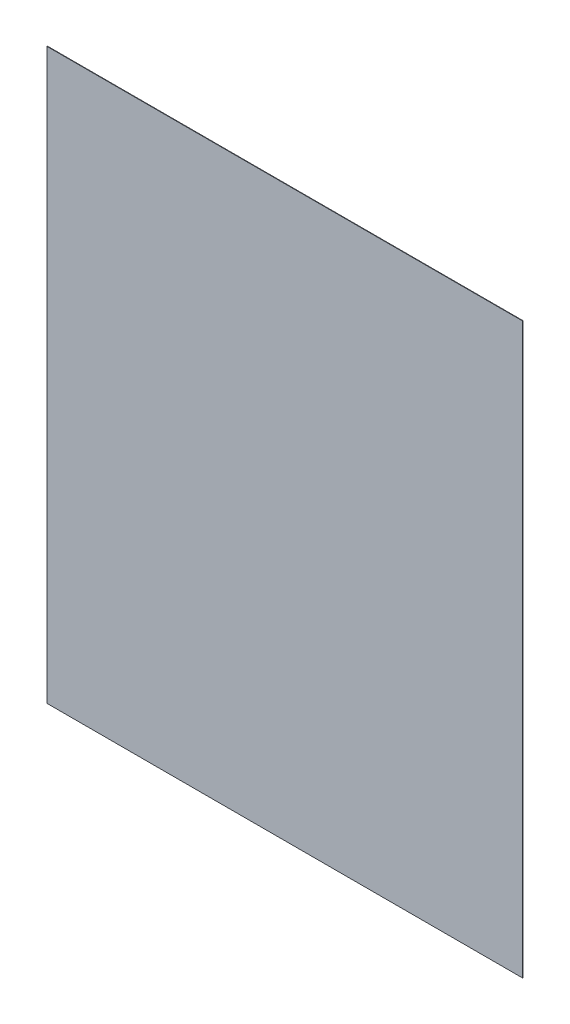
ISO-10303-21;
HEADER;
FILE_DESCRIPTION(('STEP AP214'),'2;1');
FILE_NAME('part.step','',(''),(''),'','','');
FILE_SCHEMA(('AUTOMOTIVE_DESIGN { 1 0 10303 214 1 1 1 1 }'));
ENDSEC;
DATA;
#1=APPLICATION_CONTEXT('core data for automotive mechanical design processes');
#2=APPLICATION_PROTOCOL_DEFINITION('international standard','automotive_design',2000,#1);
#3=PRODUCT_CONTEXT('',#1,'mechanical');
#4=PRODUCT('Part','Part','',(#3));
#5=PRODUCT_RELATED_PRODUCT_CATEGORY('part','',(#4));
#6=PRODUCT_DEFINITION_FORMATION('','',#4);
#7=PRODUCT_DEFINITION_CONTEXT('part definition',#1,'design');
#8=PRODUCT_DEFINITION('design','',#6,#7);
#9=PRODUCT_DEFINITION_SHAPE('','',#8);
#10=(LENGTH_UNIT() NAMED_UNIT(*) SI_UNIT(.MILLI.,.METRE.));
#11=(NAMED_UNIT(*) PLANE_ANGLE_UNIT() SI_UNIT($,.RADIAN.));
#12=(NAMED_UNIT(*) SI_UNIT($,.STERADIAN.) SOLID_ANGLE_UNIT());
#13=UNCERTAINTY_MEASURE_WITH_UNIT(LENGTH_MEASURE(1.E-05),#10,'distance_accuracy_value','');
#14=(GEOMETRIC_REPRESENTATION_CONTEXT(3) GLOBAL_UNCERTAINTY_ASSIGNED_CONTEXT((#13)) GLOBAL_UNIT_ASSIGNED_CONTEXT((#10,
#11,#12)) REPRESENTATION_CONTEXT('',''));
#15=CARTESIAN_POINT('',(0.,0.,0.));
#16=DIRECTION('',(0.,0.,1.));
#17=DIRECTION('',(1.,0.,0.));
#18=AXIS2_PLACEMENT_3D('',#15,#16,#17);
#19=CARTESIAN_POINT('',(-4.825610939252E-05,2.628178783766E-05,0.00100076));
#20=DIRECTION('',(0.,0.,1.));
#21=DIRECTION('',(1.,0.,0.));
#22=AXIS2_PLACEMENT_3D('',#19,#20,#21);
#23=PLANE('',#22);
#24=DIRECTION('',(1.,0.,0.));
#25=VECTOR('',#24,1.);
#26=CARTESIAN_POINT('',(-0.50065178,-0.5986272,0.00100076));
#27=LINE('',#26,#25);
#28=CARTESIAN_POINT('',(-0.50065178,-0.5986272,0.00100076));
#29=VERTEX_POINT('',#28);
#30=CARTESIAN_POINT('',(0.50045874,-0.5986272,0.00100076));
#31=VERTEX_POINT('',#30);
#32=EDGE_CURVE('E90',#29,#31,#27,.T.);
#33=ORIENTED_EDGE('',*,*,#32,.T.);
#34=DIRECTION('',(0.000161235571562526,0.999999987001545,0.));
#35=VECTOR('',#34,1.);
#36=CARTESIAN_POINT('',(0.50045874,-0.5986272,0.00100076));
#37=LINE('',#36,#35);
#38=CARTESIAN_POINT('',(0.50065178,0.5986272,0.00100076));
#39=VERTEX_POINT('',#38);
#40=EDGE_CURVE('E106',#31,#39,#37,.T.);
#41=ORIENTED_EDGE('',*,*,#40,.T.);
#42=DIRECTION('',(-1.,0.,0.));
#43=VECTOR('',#42,1.);
#44=CARTESIAN_POINT('',(0.50065178,0.5986272,0.00100076));
#45=LINE('',#44,#43);
#46=CARTESIAN_POINT('',(-0.50065178,0.5986272,0.00100076));
#47=VERTEX_POINT('',#46);
#48=EDGE_CURVE('E84',#39,#47,#45,.T.);
#49=ORIENTED_EDGE('',*,*,#48,.T.);
#50=DIRECTION('',(0.,-1.,0.));
#51=VECTOR('',#50,1.);
#52=CARTESIAN_POINT('',(-0.50065178,0.5986272,0.00100076));
#53=LINE('',#52,#51);
#54=EDGE_CURVE('E11',#47,#29,#53,.T.);
#55=ORIENTED_EDGE('',*,*,#54,.T.);
#56=EDGE_LOOP('',(#33,#41,#49,#55));
#57=FACE_BOUND('',#56,.T.);
#58=ADVANCED_FACE('F17',(#57),#23,.T.);
#59=CARTESIAN_POINT('',(-4.825610939252E-05,2.628178783766E-05,0.));
#60=DIRECTION('',(0.,0.,1.));
#61=DIRECTION('',(1.,0.,0.));
#62=AXIS2_PLACEMENT_3D('',#59,#60,#61);
#63=PLANE('',#62);
#64=DIRECTION('',(0.,-1.,0.));
#65=VECTOR('',#64,1.);
#66=CARTESIAN_POINT('',(-0.50065178,0.5986272,0.));
#67=LINE('',#66,#65);
#68=CARTESIAN_POINT('',(-0.50065178,0.5986272,0.));
#69=VERTEX_POINT('',#68);
#70=CARTESIAN_POINT('',(-0.50065178,-0.5986272,0.));
#71=VERTEX_POINT('',#70);
#72=EDGE_CURVE('E25',#69,#71,#67,.T.);
#73=ORIENTED_EDGE('',*,*,#72,.F.);
#74=DIRECTION('',(-1.,0.,0.));
#75=VECTOR('',#74,1.);
#76=CARTESIAN_POINT('',(0.50065178,0.5986272,0.));
#77=LINE('',#76,#75);
#78=CARTESIAN_POINT('',(0.50065178,0.5986272,0.));
#79=VERTEX_POINT('',#78);
#80=EDGE_CURVE('E58',#79,#69,#77,.T.);
#81=ORIENTED_EDGE('',*,*,#80,.F.);
#82=DIRECTION('',(0.000161235571562526,0.999999987001545,0.));
#83=VECTOR('',#82,1.);
#84=CARTESIAN_POINT('',(0.50045874,-0.5986272,0.));
#85=LINE('',#84,#83);
#86=CARTESIAN_POINT('',(0.50045874,-0.5986272,0.));
#87=VERTEX_POINT('',#86);
#88=EDGE_CURVE('E73',#87,#79,#85,.T.);
#89=ORIENTED_EDGE('',*,*,#88,.F.);
#90=DIRECTION('',(1.,0.,0.));
#91=VECTOR('',#90,1.);
#92=CARTESIAN_POINT('',(-0.50065178,-0.5986272,0.));
#93=LINE('',#92,#91);
#94=EDGE_CURVE('E89',#71,#87,#93,.T.);
#95=ORIENTED_EDGE('',*,*,#94,.F.);
#96=EDGE_LOOP('',(#73,#81,#89,#95));
#97=FACE_BOUND('',#96,.T.);
#98=ADVANCED_FACE('F93',(#97),#63,.F.);
#99=CARTESIAN_POINT('',(-0.50065178,0.5986272,0.));
#100=DIRECTION('',(1.,0.,0.));
#101=DIRECTION('',(0.,1.,0.));
#102=AXIS2_PLACEMENT_3D('',#99,#100,#101);
#103=PLANE('',#102);
#104=ORIENTED_EDGE('',*,*,#72,.T.);
#105=DIRECTION('',(0.,0.,1.));
#106=VECTOR('',#105,1.);
#107=CARTESIAN_POINT('',(-0.50065178,-0.5986272,0.));
#108=LINE('',#107,#106);
#109=EDGE_CURVE('E79',#71,#29,#108,.T.);
#110=ORIENTED_EDGE('',*,*,#109,.T.);
#111=ORIENTED_EDGE('',*,*,#54,.F.);
#112=DIRECTION('',(0.,0.,1.));
#113=VECTOR('',#112,1.);
#114=CARTESIAN_POINT('',(-0.50065178,0.5986272,0.));
#115=LINE('',#114,#113);
#116=EDGE_CURVE('E82',#69,#47,#115,.T.);
#117=ORIENTED_EDGE('',*,*,#116,.F.);
#118=EDGE_LOOP('',(#104,#110,#111,#117));
#119=FACE_BOUND('',#118,.T.);
#120=ADVANCED_FACE('F78',(#119),#103,.F.);
#121=CARTESIAN_POINT('',(0.50065178,0.5986272,0.));
#122=DIRECTION('',(0.,-1.,0.));
#123=DIRECTION('',(0.,0.,-1.));
#124=AXIS2_PLACEMENT_3D('',#121,#122,#123);
#125=PLANE('',#124);
#126=ORIENTED_EDGE('',*,*,#80,.T.);
#127=ORIENTED_EDGE('',*,*,#116,.T.);
#128=ORIENTED_EDGE('',*,*,#48,.F.);
#129=DIRECTION('',(0.,0.,1.));
#130=VECTOR('',#129,1.);
#131=CARTESIAN_POINT('',(0.50065178,0.5986272,0.));
#132=LINE('',#131,#130);
#133=EDGE_CURVE('E104',#79,#39,#132,.T.);
#134=ORIENTED_EDGE('',*,*,#133,.F.);
#135=EDGE_LOOP('',(#126,#127,#128,#134));
#136=FACE_BOUND('',#135,.T.);
#137=ADVANCED_FACE('F120',(#136),#125,.F.);
#138=CARTESIAN_POINT('',(0.50045874,-0.5986272,0.));
#139=DIRECTION('',(-0.999999987001545,0.000161235571562526,0.));
#140=DIRECTION('',(0.,0.,1.));
#141=AXIS2_PLACEMENT_3D('',#138,#139,#140);
#142=PLANE('',#141);
#143=ORIENTED_EDGE('',*,*,#88,.T.);
#144=ORIENTED_EDGE('',*,*,#133,.T.);
#145=ORIENTED_EDGE('',*,*,#40,.F.);
#146=DIRECTION('',(0.,0.,1.));
#147=VECTOR('',#146,1.);
#148=CARTESIAN_POINT('',(0.50045874,-0.5986272,0.));
#149=LINE('',#148,#147);
#150=EDGE_CURVE('E95',#87,#31,#149,.T.);
#151=ORIENTED_EDGE('',*,*,#150,.F.);
#152=EDGE_LOOP('',(#143,#144,#145,#151));
#153=FACE_BOUND('',#152,.T.);
#154=ADVANCED_FACE('F122',(#153),#142,.F.);
#155=CARTESIAN_POINT('',(-0.50065178,-0.5986272,0.));
#156=DIRECTION('',(0.,1.,0.));
#157=DIRECTION('',(1.,0.,0.));
#158=AXIS2_PLACEMENT_3D('',#155,#156,#157);
#159=PLANE('',#158);
#160=ORIENTED_EDGE('',*,*,#94,.T.);
#161=ORIENTED_EDGE('',*,*,#150,.T.);
#162=ORIENTED_EDGE('',*,*,#32,.F.);
#163=ORIENTED_EDGE('',*,*,#109,.F.);
#164=EDGE_LOOP('',(#160,#161,#162,#163));
#165=FACE_BOUND('',#164,.T.);
#166=ADVANCED_FACE('F87',(#165),#159,.F.);
#167=CLOSED_SHELL('',(#58,#98,#120,#137,#154,#166));
#168=MANIFOLD_SOLID_BREP('B1',#167);
#169=ADVANCED_BREP_SHAPE_REPRESENTATION('',(#18,#168),#14);
#170=SHAPE_DEFINITION_REPRESENTATION(#9,#169);
ENDSEC;
END-ISO-10303-21;
